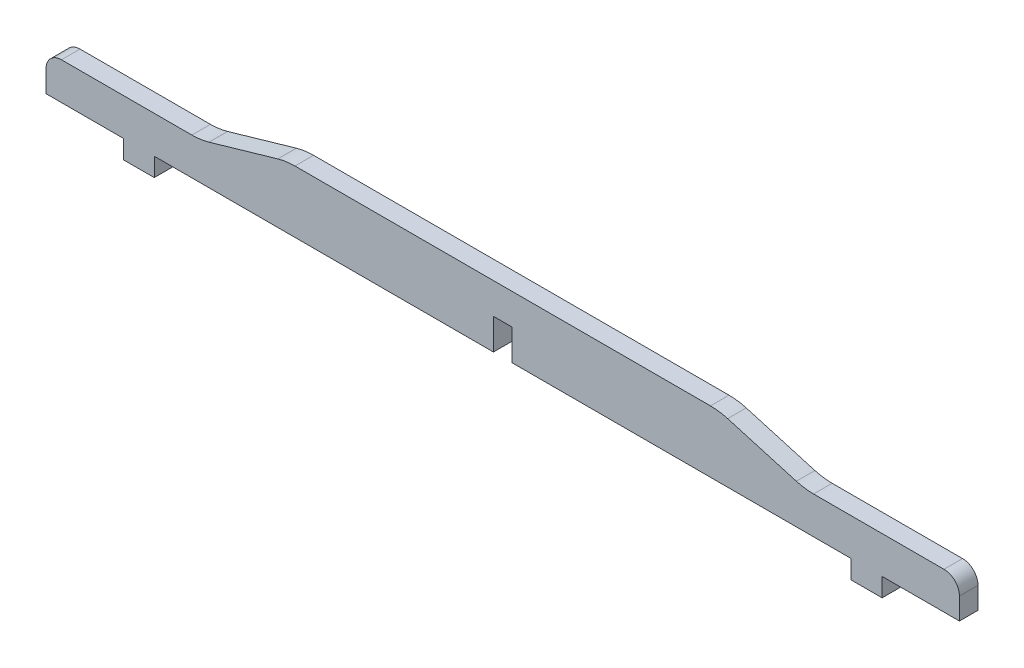
ISO-10303-21;
HEADER;
FILE_DESCRIPTION(('STEP AP214'),'2;1');
FILE_NAME('part.step','',(''),(''),'','','');
FILE_SCHEMA(('AUTOMOTIVE_DESIGN { 1 0 10303 214 1 1 1 1 }'));
ENDSEC;
DATA;
#1=APPLICATION_CONTEXT('core data for automotive mechanical design processes');
#2=APPLICATION_PROTOCOL_DEFINITION('international standard','automotive_design',2000,#1);
#3=PRODUCT_CONTEXT('',#1,'mechanical');
#4=PRODUCT('Part','Part','',(#3));
#5=PRODUCT_RELATED_PRODUCT_CATEGORY('part','',(#4));
#6=PRODUCT_DEFINITION_FORMATION('','',#4);
#7=PRODUCT_DEFINITION_CONTEXT('part definition',#1,'design');
#8=PRODUCT_DEFINITION('design','',#6,#7);
#9=PRODUCT_DEFINITION_SHAPE('','',#8);
#10=(LENGTH_UNIT() NAMED_UNIT(*) SI_UNIT(.MILLI.,.METRE.));
#11=(NAMED_UNIT(*) PLANE_ANGLE_UNIT() SI_UNIT($,.RADIAN.));
#12=(NAMED_UNIT(*) SI_UNIT($,.STERADIAN.) SOLID_ANGLE_UNIT());
#13=UNCERTAINTY_MEASURE_WITH_UNIT(LENGTH_MEASURE(1.E-05),#10,'distance_accuracy_value','');
#14=(GEOMETRIC_REPRESENTATION_CONTEXT(3) GLOBAL_UNCERTAINTY_ASSIGNED_CONTEXT((#13)) GLOBAL_UNIT_ASSIGNED_CONTEXT((#10,
#11,#12)) REPRESENTATION_CONTEXT('',''));
#15=CARTESIAN_POINT('',(0.,0.,0.));
#16=DIRECTION('',(0.,0.,1.));
#17=DIRECTION('',(1.,0.,0.));
#18=AXIS2_PLACEMENT_3D('',#15,#16,#17);
#19=CARTESIAN_POINT('',(112.66666667,-20.,6.));
#20=DIRECTION('',(0.,1.,0.));
#21=DIRECTION('',(0.,0.,1.));
#22=AXIS2_PLACEMENT_3D('',#19,#20,#21);
#23=PLANE('',#22);
#24=DIRECTION('',(1.,0.,0.));
#25=VECTOR('',#24,1.);
#26=CARTESIAN_POINT('',(112.66666667,-20.,0.));
#27=LINE('',#26,#25);
#28=CARTESIAN_POINT('',(-112.66666667,-20.,0.));
#29=VERTEX_POINT('',#28);
#30=CARTESIAN_POINT('',(-3.,-20.,0.));
#31=VERTEX_POINT('',#30);
#32=EDGE_CURVE('E230',#29,#31,#27,.T.);
#33=ORIENTED_EDGE('',*,*,#32,.T.);
#34=DIRECTION('',(0.,0.,1.));
#35=VECTOR('',#34,1.);
#36=CARTESIAN_POINT('',(-3.,-20.,0.));
#37=LINE('',#36,#35);
#38=CARTESIAN_POINT('',(-3.,-20.,6.));
#39=VERTEX_POINT('',#38);
#40=EDGE_CURVE('E212',#31,#39,#37,.T.);
#41=ORIENTED_EDGE('',*,*,#40,.T.);
#42=DIRECTION('',(1.,0.,0.));
#43=VECTOR('',#42,1.);
#44=CARTESIAN_POINT('',(112.66666667,-20.,6.));
#45=LINE('',#44,#43);
#46=CARTESIAN_POINT('',(-112.66666667,-20.,6.));
#47=VERTEX_POINT('',#46);
#48=EDGE_CURVE('E410',#47,#39,#45,.T.);
#49=ORIENTED_EDGE('',*,*,#48,.F.);
#50=DIRECTION('',(0.,0.,-1.));
#51=VECTOR('',#50,1.);
#52=CARTESIAN_POINT('',(-112.66666667,-20.,6.));
#53=LINE('',#52,#51);
#54=EDGE_CURVE('E237',#47,#29,#53,.T.);
#55=ORIENTED_EDGE('',*,*,#54,.T.);
#56=EDGE_LOOP('',(#33,#41,#49,#55));
#57=FACE_BOUND('',#56,.T.);
#58=ADVANCED_FACE('F38',(#57),#23,.F.);
#59=CARTESIAN_POINT('',(122.66666667,-26.,6.));
#60=DIRECTION('',(-1.,0.,0.));
#61=DIRECTION('',(0.,0.,1.));
#62=AXIS2_PLACEMENT_3D('',#59,#60,#61);
#63=PLANE('',#62);
#64=DIRECTION('',(0.,1.,0.));
#65=VECTOR('',#64,1.);
#66=CARTESIAN_POINT('',(122.66666667,-26.,0.));
#67=LINE('',#66,#65);
#68=CARTESIAN_POINT('',(122.66666667,-26.,0.));
#69=VERTEX_POINT('',#68);
#70=CARTESIAN_POINT('',(122.66666667,-20.,0.));
#71=VERTEX_POINT('',#70);
#72=EDGE_CURVE('E418',#69,#71,#67,.T.);
#73=ORIENTED_EDGE('',*,*,#72,.T.);
#74=DIRECTION('',(0.,0.,-1.));
#75=VECTOR('',#74,1.);
#76=CARTESIAN_POINT('',(122.66666667,-20.,6.));
#77=LINE('',#76,#75);
#78=CARTESIAN_POINT('',(122.66666667,-20.,6.));
#79=VERTEX_POINT('',#78);
#80=EDGE_CURVE('E288',#79,#71,#77,.T.);
#81=ORIENTED_EDGE('',*,*,#80,.F.);
#82=DIRECTION('',(0.,1.,0.));
#83=VECTOR('',#82,1.);
#84=CARTESIAN_POINT('',(122.66666667,-26.,6.));
#85=LINE('',#84,#83);
#86=CARTESIAN_POINT('',(122.66666667,-26.,6.));
#87=VERTEX_POINT('',#86);
#88=EDGE_CURVE('E252',#87,#79,#85,.T.);
#89=ORIENTED_EDGE('',*,*,#88,.F.);
#90=DIRECTION('',(0.,0.,-1.));
#91=VECTOR('',#90,1.);
#92=CARTESIAN_POINT('',(122.66666667,-26.,6.));
#93=LINE('',#92,#91);
#94=EDGE_CURVE('E253',#87,#69,#93,.T.);
#95=ORIENTED_EDGE('',*,*,#94,.T.);
#96=EDGE_LOOP('',(#73,#81,#89,#95));
#97=FACE_BOUND('',#96,.T.);
#98=ADVANCED_FACE('F494',(#97),#63,.F.);
#99=CARTESIAN_POINT('',(147.66666667,-20.,6.));
#100=DIRECTION('',(0.,1.,0.));
#101=DIRECTION('',(0.,0.,1.));
#102=AXIS2_PLACEMENT_3D('',#99,#100,#101);
#103=PLANE('',#102);
#104=DIRECTION('',(1.,0.,0.));
#105=VECTOR('',#104,1.);
#106=CARTESIAN_POINT('',(147.66666667,-20.,0.));
#107=LINE('',#106,#105);
#108=CARTESIAN_POINT('',(147.66666667,-20.,0.));
#109=VERTEX_POINT('',#108);
#110=EDGE_CURVE('E422',#71,#109,#107,.T.);
#111=ORIENTED_EDGE('',*,*,#110,.T.);
#112=DIRECTION('',(0.,0.,-1.));
#113=VECTOR('',#112,1.);
#114=CARTESIAN_POINT('',(147.66666667,-20.,6.));
#115=LINE('',#114,#113);
#116=CARTESIAN_POINT('',(147.66666667,-20.,6.));
#117=VERTEX_POINT('',#116);
#118=EDGE_CURVE('E284',#117,#109,#115,.T.);
#119=ORIENTED_EDGE('',*,*,#118,.F.);
#120=DIRECTION('',(1.,0.,0.));
#121=VECTOR('',#120,1.);
#122=CARTESIAN_POINT('',(147.66666667,-20.,6.));
#123=LINE('',#122,#121);
#124=EDGE_CURVE('E543',#79,#117,#123,.T.);
#125=ORIENTED_EDGE('',*,*,#124,.F.);
#126=ORIENTED_EDGE('',*,*,#80,.T.);
#127=EDGE_LOOP('',(#111,#119,#125,#126));
#128=FACE_BOUND('',#127,.T.);
#129=ADVANCED_FACE('F502',(#128),#103,.F.);
#130=CARTESIAN_POINT('',(147.66666667,-8.00000000000002,6.));
#131=DIRECTION('',(-1.,0.,0.));
#132=DIRECTION('',(0.,-1.,0.));
#133=AXIS2_PLACEMENT_3D('',#130,#131,#132);
#134=PLANE('',#133);
#135=DIRECTION('',(0.,1.,0.));
#136=VECTOR('',#135,1.);
#137=CARTESIAN_POINT('',(147.66666667,-8.00000000000002,0.));
#138=LINE('',#137,#136);
#139=CARTESIAN_POINT('',(147.66666667,-13.,0.));
#140=VERTEX_POINT('',#139);
#141=EDGE_CURVE('E425',#109,#140,#138,.T.);
#142=ORIENTED_EDGE('',*,*,#141,.T.);
#143=DIRECTION('',(0.,0.,-1.));
#144=VECTOR('',#143,1.);
#145=CARTESIAN_POINT('',(147.66666667,-13.,6.));
#146=LINE('',#145,#144);
#147=CARTESIAN_POINT('',(147.66666667,-13.,6.));
#148=VERTEX_POINT('',#147);
#149=EDGE_CURVE('E303',#140,#148,#146,.F.);
#150=ORIENTED_EDGE('',*,*,#149,.T.);
#151=DIRECTION('',(0.,1.,0.));
#152=VECTOR('',#151,1.);
#153=CARTESIAN_POINT('',(147.66666667,-8.00000000000002,6.));
#154=LINE('',#153,#152);
#155=EDGE_CURVE('E546',#117,#148,#154,.T.);
#156=ORIENTED_EDGE('',*,*,#155,.F.);
#157=ORIENTED_EDGE('',*,*,#118,.T.);
#158=EDGE_LOOP('',(#142,#150,#156,#157));
#159=FACE_BOUND('',#158,.T.);
#160=ADVANCED_FACE('F587',(#159),#134,.F.);
#161=CARTESIAN_POINT('',(97.66666667,-8.00000000000002,6.));
#162=DIRECTION('',(0.,-1.,0.));
#163=DIRECTION('',(1.,0.,0.));
#164=AXIS2_PLACEMENT_3D('',#161,#162,#163);
#165=PLANE('',#164);
#166=DIRECTION('',(-1.,0.,0.));
#167=VECTOR('',#166,1.);
#168=CARTESIAN_POINT('',(97.66666667,-8.00000000000002,0.));
#169=LINE('',#168,#167);
#170=CARTESIAN_POINT('',(142.66666667,-8.00000000000002,0.));
#171=VERTEX_POINT('',#170);
#172=CARTESIAN_POINT('',(100.500192903982,-8.00000000000002,0.));
#173=VERTEX_POINT('',#172);
#174=EDGE_CURVE('E429',#171,#173,#169,.T.);
#175=ORIENTED_EDGE('',*,*,#174,.T.);
#176=DIRECTION('',(0.,0.,-1.));
#177=VECTOR('',#176,1.);
#178=CARTESIAN_POINT('',(100.500192903982,-8.00000000000002,6.));
#179=LINE('',#178,#177);
#180=CARTESIAN_POINT('',(100.500192903982,-8.00000000000002,6.));
#181=VERTEX_POINT('',#180);
#182=EDGE_CURVE('E327',#173,#181,#179,.F.);
#183=ORIENTED_EDGE('',*,*,#182,.T.);
#184=DIRECTION('',(-1.,0.,0.));
#185=VECTOR('',#184,1.);
#186=CARTESIAN_POINT('',(97.66666667,-8.00000000000002,6.));
#187=LINE('',#186,#185);
#188=CARTESIAN_POINT('',(142.66666667,-8.00000000000002,6.));
#189=VERTEX_POINT('',#188);
#190=EDGE_CURVE('E550',#189,#181,#187,.T.);
#191=ORIENTED_EDGE('',*,*,#190,.F.);
#192=DIRECTION('',(0.,0.,-1.));
#193=VECTOR('',#192,1.);
#194=CARTESIAN_POINT('',(142.66666667,-8.00000000000002,6.));
#195=LINE('',#194,#193);
#196=EDGE_CURVE('E292',#189,#171,#195,.T.);
#197=ORIENTED_EDGE('',*,*,#196,.T.);
#198=EDGE_LOOP('',(#175,#183,#191,#197));
#199=FACE_BOUND('',#198,.T.);
#200=ADVANCED_FACE('F580',(#199),#165,.F.);
#201=CARTESIAN_POINT('',(70.,0.,6.));
#202=DIRECTION('',(-0.277777033532158,-0.960645574414453,0.));
#203=DIRECTION('',(0.960645574414453,-0.277777033532158,0.));
#204=AXIS2_PLACEMENT_3D('',#201,#202,#203);
#205=PLANE('',#204);
#206=DIRECTION('',(-0.960645574414453,0.277777033532158,0.));
#207=VECTOR('',#206,1.);
#208=CARTESIAN_POINT('',(70.,0.,6.));
#209=LINE('',#208,#207);
#210=CARTESIAN_POINT('',(94.9446522333384,-7.21291148828908,6.));
#211=VERTEX_POINT('',#210);
#212=CARTESIAN_POINT('',(72.7220144366616,-0.787088511710961,6.));
#213=VERTEX_POINT('',#212);
#214=EDGE_CURVE('E554',#211,#213,#209,.T.);
#215=ORIENTED_EDGE('',*,*,#214,.F.);
#216=DIRECTION('',(0.,0.,-1.));
#217=VECTOR('',#216,1.);
#218=CARTESIAN_POINT('',(94.9446522333384,-7.21291148828908,0.));
#219=LINE('',#218,#217);
#220=CARTESIAN_POINT('',(94.9446522333384,-7.21291148828908,0.));
#221=VERTEX_POINT('',#220);
#222=EDGE_CURVE('E323',#211,#221,#219,.T.);
#223=ORIENTED_EDGE('',*,*,#222,.T.);
#224=DIRECTION('',(-0.960645574414453,0.277777033532158,0.));
#225=VECTOR('',#224,1.);
#226=CARTESIAN_POINT('',(70.,0.,0.));
#227=LINE('',#226,#225);
#228=CARTESIAN_POINT('',(72.7220144366616,-0.787088511710961,0.));
#229=VERTEX_POINT('',#228);
#230=EDGE_CURVE('E433',#221,#229,#227,.T.);
#231=ORIENTED_EDGE('',*,*,#230,.T.);
#232=DIRECTION('',(0.,0.,-1.));
#233=VECTOR('',#232,1.);
#234=CARTESIAN_POINT('',(72.7220144366616,-0.787088511710961,6.));
#235=LINE('',#234,#233);
#236=EDGE_CURVE('E320',#229,#213,#235,.F.);
#237=ORIENTED_EDGE('',*,*,#236,.T.);
#238=EDGE_LOOP('',(#215,#223,#231,#237));
#239=FACE_BOUND('',#238,.T.);
#240=ADVANCED_FACE('F574',(#239),#205,.F.);
#241=CARTESIAN_POINT('',(70.,0.,6.));
#242=DIRECTION('',(0.,-1.,0.));
#243=DIRECTION('',(0.,0.,-1.));
#244=AXIS2_PLACEMENT_3D('',#241,#242,#243);
#245=PLANE('',#244);
#246=DIRECTION('',(-1.,0.,0.));
#247=VECTOR('',#246,1.);
#248=CARTESIAN_POINT('',(70.,0.,6.));
#249=LINE('',#248,#247);
#250=CARTESIAN_POINT('',(67.1664737660185,0.,6.));
#251=VERTEX_POINT('',#250);
#252=CARTESIAN_POINT('',(-67.1664737660185,0.,6.));
#253=VERTEX_POINT('',#252);
#254=EDGE_CURVE('E394',#251,#253,#249,.T.);
#255=ORIENTED_EDGE('',*,*,#254,.F.);
#256=DIRECTION('',(0.,0.,-1.));
#257=VECTOR('',#256,1.);
#258=CARTESIAN_POINT('',(67.1664737660185,0.,6.));
#259=LINE('',#258,#257);
#260=CARTESIAN_POINT('',(67.1664737660185,0.,0.));
#261=VERTEX_POINT('',#260);
#262=EDGE_CURVE('E333',#251,#261,#259,.T.);
#263=ORIENTED_EDGE('',*,*,#262,.T.);
#264=DIRECTION('',(-1.,0.,0.));
#265=VECTOR('',#264,1.);
#266=CARTESIAN_POINT('',(70.,0.,0.));
#267=LINE('',#266,#265);
#268=CARTESIAN_POINT('',(-67.1664737660185,0.,0.));
#269=VERTEX_POINT('',#268);
#270=EDGE_CURVE('E379',#261,#269,#267,.T.);
#271=ORIENTED_EDGE('',*,*,#270,.T.);
#272=DIRECTION('',(0.,0.,-1.));
#273=VECTOR('',#272,1.);
#274=CARTESIAN_POINT('',(-67.1664737660185,0.,6.));
#275=LINE('',#274,#273);
#276=EDGE_CURVE('E330',#269,#253,#275,.F.);
#277=ORIENTED_EDGE('',*,*,#276,.T.);
#278=EDGE_LOOP('',(#255,#263,#271,#277));
#279=FACE_BOUND('',#278,.T.);
#280=ADVANCED_FACE('F568',(#279),#245,.F.);
#281=CARTESIAN_POINT('',(-97.66666667,-8.00000000000002,6.));
#282=DIRECTION('',(0.277777033532158,-0.960645574414453,0.));
#283=DIRECTION('',(0.960645574414453,0.277777033532158,0.));
#284=AXIS2_PLACEMENT_3D('',#281,#282,#283);
#285=PLANE('',#284);
#286=DIRECTION('',(-0.960645574414453,-0.277777033532158,0.));
#287=VECTOR('',#286,1.);
#288=CARTESIAN_POINT('',(-97.66666667,-8.00000000000002,6.));
#289=LINE('',#288,#287);
#290=CARTESIAN_POINT('',(-72.7220144366616,-0.787088511710957,6.));
#291=VERTEX_POINT('',#290);
#292=CARTESIAN_POINT('',(-94.9446522333383,-7.21291148828908,6.));
#293=VERTEX_POINT('',#292);
#294=EDGE_CURVE('E388',#291,#293,#289,.T.);
#295=ORIENTED_EDGE('',*,*,#294,.F.);
#296=DIRECTION('',(0.,0.,-1.));
#297=VECTOR('',#296,1.);
#298=CARTESIAN_POINT('',(-72.7220144366616,-0.787088511710958,6.));
#299=LINE('',#298,#297);
#300=CARTESIAN_POINT('',(-72.7220144366616,-0.787088511710957,0.));
#301=VERTEX_POINT('',#300);
#302=EDGE_CURVE('E352',#291,#301,#299,.T.);
#303=ORIENTED_EDGE('',*,*,#302,.T.);
#304=DIRECTION('',(-0.960645574414453,-0.277777033532158,0.));
#305=VECTOR('',#304,1.);
#306=CARTESIAN_POINT('',(-97.66666667,-8.00000000000002,0.));
#307=LINE('',#306,#305);
#308=CARTESIAN_POINT('',(-94.9446522333383,-7.21291148828908,0.));
#309=VERTEX_POINT('',#308);
#310=EDGE_CURVE('E369',#301,#309,#307,.T.);
#311=ORIENTED_EDGE('',*,*,#310,.T.);
#312=DIRECTION('',(0.,0.,-1.));
#313=VECTOR('',#312,1.);
#314=CARTESIAN_POINT('',(-94.9446522333383,-7.21291148828908,6.));
#315=LINE('',#314,#313);
#316=EDGE_CURVE('E349',#309,#293,#315,.F.);
#317=ORIENTED_EDGE('',*,*,#316,.T.);
#318=EDGE_LOOP('',(#295,#303,#311,#317));
#319=FACE_BOUND('',#318,.T.);
#320=ADVANCED_FACE('F376',(#319),#285,.F.);
#321=CARTESIAN_POINT('',(-147.66666667,-8.00000000000002,6.));
#322=DIRECTION('',(0.,-1.,0.));
#323=DIRECTION('',(1.,0.,0.));
#324=AXIS2_PLACEMENT_3D('',#321,#322,#323);
#325=PLANE('',#324);
#326=DIRECTION('',(-1.,0.,0.));
#327=VECTOR('',#326,1.);
#328=CARTESIAN_POINT('',(-147.66666667,-8.00000000000002,6.));
#329=LINE('',#328,#327);
#330=CARTESIAN_POINT('',(-100.500192903981,-8.00000000000002,6.));
#331=VERTEX_POINT('',#330);
#332=CARTESIAN_POINT('',(-142.66666667,-8.00000000000002,6.));
#333=VERTEX_POINT('',#332);
#334=EDGE_CURVE('E383',#331,#333,#329,.T.);
#335=ORIENTED_EDGE('',*,*,#334,.F.);
#336=DIRECTION('',(0.,0.,-1.));
#337=VECTOR('',#336,1.);
#338=CARTESIAN_POINT('',(-100.500192903981,-8.00000000000003,0.));
#339=LINE('',#338,#337);
#340=CARTESIAN_POINT('',(-100.500192903981,-8.00000000000002,0.));
#341=VERTEX_POINT('',#340);
#342=EDGE_CURVE('E356',#331,#341,#339,.T.);
#343=ORIENTED_EDGE('',*,*,#342,.T.);
#344=DIRECTION('',(-1.,0.,0.));
#345=VECTOR('',#344,1.);
#346=CARTESIAN_POINT('',(-147.66666667,-8.00000000000002,0.));
#347=LINE('',#346,#345);
#348=CARTESIAN_POINT('',(-142.66666667,-8.00000000000002,0.));
#349=VERTEX_POINT('',#348);
#350=EDGE_CURVE('E370',#341,#349,#347,.T.);
#351=ORIENTED_EDGE('',*,*,#350,.T.);
#352=DIRECTION('',(0.,0.,-1.));
#353=VECTOR('',#352,1.);
#354=CARTESIAN_POINT('',(-142.66666667,-8.00000000000002,6.));
#355=LINE('',#354,#353);
#356=EDGE_CURVE('E316',#349,#333,#355,.F.);
#357=ORIENTED_EDGE('',*,*,#356,.T.);
#358=EDGE_LOOP('',(#335,#343,#351,#357));
#359=FACE_BOUND('',#358,.T.);
#360=ADVANCED_FACE('F382',(#359),#325,.F.);
#361=CARTESIAN_POINT('',(-147.66666667,-20.,6.));
#362=DIRECTION('',(1.,0.,0.));
#363=DIRECTION('',(0.,1.,0.));
#364=AXIS2_PLACEMENT_3D('',#361,#362,#363);
#365=PLANE('',#364);
#366=DIRECTION('',(0.,-1.,0.));
#367=VECTOR('',#366,1.);
#368=CARTESIAN_POINT('',(-147.66666667,-20.,6.));
#369=LINE('',#368,#367);
#370=CARTESIAN_POINT('',(-147.66666667,-13.,6.));
#371=VERTEX_POINT('',#370);
#372=CARTESIAN_POINT('',(-147.66666667,-20.,6.));
#373=VERTEX_POINT('',#372);
#374=EDGE_CURVE('E387',#371,#373,#369,.T.);
#375=ORIENTED_EDGE('',*,*,#374,.F.);
#376=DIRECTION('',(0.,0.,-1.));
#377=VECTOR('',#376,1.);
#378=CARTESIAN_POINT('',(-147.66666667,-13.,6.));
#379=LINE('',#378,#377);
#380=CARTESIAN_POINT('',(-147.66666667,-13.,0.));
#381=VERTEX_POINT('',#380);
#382=EDGE_CURVE('E312',#371,#381,#379,.T.);
#383=ORIENTED_EDGE('',*,*,#382,.T.);
#384=DIRECTION('',(0.,-1.,0.));
#385=VECTOR('',#384,1.);
#386=CARTESIAN_POINT('',(-147.66666667,-20.,0.));
#387=LINE('',#386,#385);
#388=CARTESIAN_POINT('',(-147.66666667,-20.,0.));
#389=VERTEX_POINT('',#388);
#390=EDGE_CURVE('E442',#381,#389,#387,.T.);
#391=ORIENTED_EDGE('',*,*,#390,.T.);
#392=DIRECTION('',(0.,0.,-1.));
#393=VECTOR('',#392,1.);
#394=CARTESIAN_POINT('',(-147.66666667,-20.,6.));
#395=LINE('',#394,#393);
#396=EDGE_CURVE('E280',#373,#389,#395,.T.);
#397=ORIENTED_EDGE('',*,*,#396,.F.);
#398=EDGE_LOOP('',(#375,#383,#391,#397));
#399=FACE_BOUND('',#398,.T.);
#400=ADVANCED_FACE('F476',(#399),#365,.F.);
#401=CARTESIAN_POINT('',(-147.66666667,-20.,6.));
#402=DIRECTION('',(0.,1.,0.));
#403=DIRECTION('',(0.,0.,1.));
#404=AXIS2_PLACEMENT_3D('',#401,#402,#403);
#405=PLANE('',#404);
#406=DIRECTION('',(1.,0.,0.));
#407=VECTOR('',#406,1.);
#408=CARTESIAN_POINT('',(-147.66666667,-20.,0.));
#409=LINE('',#408,#407);
#410=CARTESIAN_POINT('',(-122.66666667,-20.,0.));
#411=VERTEX_POINT('',#410);
#412=EDGE_CURVE('E445',#389,#411,#409,.T.);
#413=ORIENTED_EDGE('',*,*,#412,.T.);
#414=DIRECTION('',(0.,0.,-1.));
#415=VECTOR('',#414,1.);
#416=CARTESIAN_POINT('',(-122.66666667,-20.,6.));
#417=LINE('',#416,#415);
#418=CARTESIAN_POINT('',(-122.66666667,-20.,6.));
#419=VERTEX_POINT('',#418);
#420=EDGE_CURVE('E276',#419,#411,#417,.T.);
#421=ORIENTED_EDGE('',*,*,#420,.F.);
#422=DIRECTION('',(1.,0.,0.));
#423=VECTOR('',#422,1.);
#424=CARTESIAN_POINT('',(-147.66666667,-20.,6.));
#425=LINE('',#424,#423);
#426=EDGE_CURVE('E392',#373,#419,#425,.T.);
#427=ORIENTED_EDGE('',*,*,#426,.F.);
#428=ORIENTED_EDGE('',*,*,#396,.T.);
#429=EDGE_LOOP('',(#413,#421,#427,#428));
#430=FACE_BOUND('',#429,.T.);
#431=ADVANCED_FACE('F474',(#430),#405,.F.);
#432=CARTESIAN_POINT('',(-122.66666667,-20.,6.));
#433=DIRECTION('',(1.,0.,0.));
#434=DIRECTION('',(0.,0.,-1.));
#435=AXIS2_PLACEMENT_3D('',#432,#433,#434);
#436=PLANE('',#435);
#437=DIRECTION('',(0.,-1.,0.));
#438=VECTOR('',#437,1.);
#439=CARTESIAN_POINT('',(-122.66666667,-20.,0.));
#440=LINE('',#439,#438);
#441=CARTESIAN_POINT('',(-122.66666667,-26.,0.));
#442=VERTEX_POINT('',#441);
#443=EDGE_CURVE('E448',#411,#442,#440,.T.);
#444=ORIENTED_EDGE('',*,*,#443,.T.);
#445=DIRECTION('',(0.,0.,-1.));
#446=VECTOR('',#445,1.);
#447=CARTESIAN_POINT('',(-122.66666667,-26.,6.));
#448=LINE('',#447,#446);
#449=CARTESIAN_POINT('',(-122.66666667,-26.,6.));
#450=VERTEX_POINT('',#449);
#451=EDGE_CURVE('E272',#450,#442,#448,.T.);
#452=ORIENTED_EDGE('',*,*,#451,.F.);
#453=DIRECTION('',(0.,-1.,0.));
#454=VECTOR('',#453,1.);
#455=CARTESIAN_POINT('',(-122.66666667,-20.,6.));
#456=LINE('',#455,#454);
#457=EDGE_CURVE('E400',#419,#450,#456,.T.);
#458=ORIENTED_EDGE('',*,*,#457,.F.);
#459=ORIENTED_EDGE('',*,*,#420,.T.);
#460=EDGE_LOOP('',(#444,#452,#458,#459));
#461=FACE_BOUND('',#460,.T.);
#462=ADVANCED_FACE('F464',(#461),#436,.F.);
#463=CARTESIAN_POINT('',(-122.66666667,-26.,6.));
#464=DIRECTION('',(0.,1.,0.));
#465=DIRECTION('',(0.,0.,1.));
#466=AXIS2_PLACEMENT_3D('',#463,#464,#465);
#467=PLANE('',#466);
#468=DIRECTION('',(1.,0.,0.));
#469=VECTOR('',#468,1.);
#470=CARTESIAN_POINT('',(-122.66666667,-26.,0.));
#471=LINE('',#470,#469);
#472=CARTESIAN_POINT('',(-112.66666667,-26.,0.));
#473=VERTEX_POINT('',#472);
#474=EDGE_CURVE('E450',#442,#473,#471,.T.);
#475=ORIENTED_EDGE('',*,*,#474,.T.);
#476=DIRECTION('',(0.,0.,-1.));
#477=VECTOR('',#476,1.);
#478=CARTESIAN_POINT('',(-112.66666667,-26.,6.));
#479=LINE('',#478,#477);
#480=CARTESIAN_POINT('',(-112.66666667,-26.,6.));
#481=VERTEX_POINT('',#480);
#482=EDGE_CURVE('E268',#481,#473,#479,.T.);
#483=ORIENTED_EDGE('',*,*,#482,.F.);
#484=DIRECTION('',(1.,0.,0.));
#485=VECTOR('',#484,1.);
#486=CARTESIAN_POINT('',(-122.66666667,-26.,6.));
#487=LINE('',#486,#485);
#488=EDGE_CURVE('E403',#450,#481,#487,.T.);
#489=ORIENTED_EDGE('',*,*,#488,.F.);
#490=ORIENTED_EDGE('',*,*,#451,.T.);
#491=EDGE_LOOP('',(#475,#483,#489,#490));
#492=FACE_BOUND('',#491,.T.);
#493=ADVANCED_FACE('F468',(#492),#467,.F.);
#494=CARTESIAN_POINT('',(-112.66666667,-26.,6.));
#495=DIRECTION('',(-1.,0.,0.));
#496=DIRECTION('',(0.,0.,1.));
#497=AXIS2_PLACEMENT_3D('',#494,#495,#496);
#498=PLANE('',#497);
#499=DIRECTION('',(0.,1.,0.));
#500=VECTOR('',#499,1.);
#501=CARTESIAN_POINT('',(-112.66666667,-26.,0.));
#502=LINE('',#501,#500);
#503=EDGE_CURVE('E246',#473,#29,#502,.T.);
#504=ORIENTED_EDGE('',*,*,#503,.T.);
#505=ORIENTED_EDGE('',*,*,#54,.F.);
#506=DIRECTION('',(0.,1.,0.));
#507=VECTOR('',#506,1.);
#508=CARTESIAN_POINT('',(-112.66666667,-26.,6.));
#509=LINE('',#508,#507);
#510=EDGE_CURVE('E406',#481,#47,#509,.T.);
#511=ORIENTED_EDGE('',*,*,#510,.F.);
#512=ORIENTED_EDGE('',*,*,#482,.T.);
#513=EDGE_LOOP('',(#504,#505,#511,#512));
#514=FACE_BOUND('',#513,.T.);
#515=ADVANCED_FACE('F457',(#514),#498,.F.);
#516=CARTESIAN_POINT('',(3.,-20.,6.));
#517=VERTEX_POINT('',#516);
#518=CARTESIAN_POINT('',(112.66666667,-20.,6.));
#519=VERTEX_POINT('',#518);
#520=EDGE_CURVE('E409',#517,#519,#45,.T.);
#521=ORIENTED_EDGE('',*,*,#520,.F.);
#522=DIRECTION('',(0.,0.,1.));
#523=VECTOR('',#522,1.);
#524=CARTESIAN_POINT('',(3.,-20.,0.));
#525=LINE('',#524,#523);
#526=CARTESIAN_POINT('',(3.,-20.,0.));
#527=VERTEX_POINT('',#526);
#528=EDGE_CURVE('E224',#527,#517,#525,.T.);
#529=ORIENTED_EDGE('',*,*,#528,.F.);
#530=CARTESIAN_POINT('',(112.66666667,-20.,0.));
#531=VERTEX_POINT('',#530);
#532=EDGE_CURVE('E240',#527,#531,#27,.T.);
#533=ORIENTED_EDGE('',*,*,#532,.T.);
#534=DIRECTION('',(0.,0.,-1.));
#535=VECTOR('',#534,1.);
#536=CARTESIAN_POINT('',(112.66666667,-20.,6.));
#537=LINE('',#536,#535);
#538=EDGE_CURVE('E262',#519,#531,#537,.T.);
#539=ORIENTED_EDGE('',*,*,#538,.F.);
#540=EDGE_LOOP('',(#521,#529,#533,#539));
#541=FACE_BOUND('',#540,.T.);
#542=ADVANCED_FACE('F496',(#541),#23,.F.);
#543=CARTESIAN_POINT('',(112.66666667,-20.,6.));
#544=DIRECTION('',(1.,0.,0.));
#545=DIRECTION('',(0.,0.,-1.));
#546=AXIS2_PLACEMENT_3D('',#543,#544,#545);
#547=PLANE('',#546);
#548=DIRECTION('',(0.,-1.,0.));
#549=VECTOR('',#548,1.);
#550=CARTESIAN_POINT('',(112.66666667,-20.,0.));
#551=LINE('',#550,#549);
#552=CARTESIAN_POINT('',(112.66666667,-26.,0.));
#553=VERTEX_POINT('',#552);
#554=EDGE_CURVE('E239',#531,#553,#551,.T.);
#555=ORIENTED_EDGE('',*,*,#554,.T.);
#556=DIRECTION('',(0.,0.,-1.));
#557=VECTOR('',#556,1.);
#558=CARTESIAN_POINT('',(112.66666667,-26.,6.));
#559=LINE('',#558,#557);
#560=CARTESIAN_POINT('',(112.66666667,-26.,6.));
#561=VERTEX_POINT('',#560);
#562=EDGE_CURVE('E257',#561,#553,#559,.T.);
#563=ORIENTED_EDGE('',*,*,#562,.F.);
#564=DIRECTION('',(0.,-1.,0.));
#565=VECTOR('',#564,1.);
#566=CARTESIAN_POINT('',(112.66666667,-20.,6.));
#567=LINE('',#566,#565);
#568=EDGE_CURVE('E413',#519,#561,#567,.T.);
#569=ORIENTED_EDGE('',*,*,#568,.F.);
#570=ORIENTED_EDGE('',*,*,#538,.T.);
#571=EDGE_LOOP('',(#555,#563,#569,#570));
#572=FACE_BOUND('',#571,.T.);
#573=ADVANCED_FACE('F507',(#572),#547,.F.);
#574=CARTESIAN_POINT('',(112.66666667,-26.,6.));
#575=DIRECTION('',(0.,1.,0.));
#576=DIRECTION('',(0.,0.,1.));
#577=AXIS2_PLACEMENT_3D('',#574,#575,#576);
#578=PLANE('',#577);
#579=DIRECTION('',(1.,0.,0.));
#580=VECTOR('',#579,1.);
#581=CARTESIAN_POINT('',(112.66666667,-26.,0.));
#582=LINE('',#581,#580);
#583=EDGE_CURVE('E244',#553,#69,#582,.T.);
#584=ORIENTED_EDGE('',*,*,#583,.T.);
#585=ORIENTED_EDGE('',*,*,#94,.F.);
#586=DIRECTION('',(1.,0.,0.));
#587=VECTOR('',#586,1.);
#588=CARTESIAN_POINT('',(112.66666667,-26.,6.));
#589=LINE('',#588,#587);
#590=EDGE_CURVE('E258',#561,#87,#589,.T.);
#591=ORIENTED_EDGE('',*,*,#590,.F.);
#592=ORIENTED_EDGE('',*,*,#562,.T.);
#593=EDGE_LOOP('',(#584,#585,#591,#592));
#594=FACE_BOUND('',#593,.T.);
#595=ADVANCED_FACE('F513',(#594),#578,.F.);
#596=CARTESIAN_POINT('',(0.,0.,6.));
#597=DIRECTION('',(0.,0.,1.));
#598=DIRECTION('',(1.,0.,0.));
#599=AXIS2_PLACEMENT_3D('',#596,#597,#598);
#600=PLANE('',#599);
#601=DIRECTION('',(0.,-1.,0.));
#602=VECTOR('',#601,1.);
#603=CARTESIAN_POINT('',(-3.,0.,6.));
#604=LINE('',#603,#602);
#605=CARTESIAN_POINT('',(-3.,-10.,6.));
#606=VERTEX_POINT('',#605);
#607=EDGE_CURVE('E218',#606,#39,#604,.T.);
#608=ORIENTED_EDGE('',*,*,#607,.F.);
#609=DIRECTION('',(-1.,0.,0.));
#610=VECTOR('',#609,1.);
#611=CARTESIAN_POINT('',(0.,-10.,6.));
#612=LINE('',#611,#610);
#613=CARTESIAN_POINT('',(3.,-10.,6.));
#614=VERTEX_POINT('',#613);
#615=EDGE_CURVE('E526',#614,#606,#612,.T.);
#616=ORIENTED_EDGE('',*,*,#615,.F.);
#617=DIRECTION('',(0.,1.,0.));
#618=VECTOR('',#617,1.);
#619=CARTESIAN_POINT('',(3.,0.,6.));
#620=LINE('',#619,#618);
#621=EDGE_CURVE('E525',#517,#614,#620,.T.);
#622=ORIENTED_EDGE('',*,*,#621,.F.);
#623=ORIENTED_EDGE('',*,*,#520,.T.);
#624=ORIENTED_EDGE('',*,*,#568,.T.);
#625=ORIENTED_EDGE('',*,*,#590,.T.);
#626=ORIENTED_EDGE('',*,*,#88,.T.);
#627=ORIENTED_EDGE('',*,*,#124,.T.);
#628=ORIENTED_EDGE('',*,*,#155,.T.);
#629=CARTESIAN_POINT('',(142.66666667,-13.,6.));
#630=DIRECTION('',(0.,0.,1.));
#631=DIRECTION('',(1.,0.,0.));
#632=AXIS2_PLACEMENT_3D('',#629,#630,#631);
#633=CIRCLE('',#632,5.);
#634=EDGE_CURVE('E309',#148,#189,#633,.T.);
#635=ORIENTED_EDGE('',*,*,#634,.T.);
#636=ORIENTED_EDGE('',*,*,#190,.T.);
#637=CARTESIAN_POINT('',(100.500192903982,12.,6.));
#638=DIRECTION('',(0.,0.,1.));
#639=DIRECTION('',(1.,0.,0.));
#640=AXIS2_PLACEMENT_3D('',#637,#638,#639);
#641=CIRCLE('',#640,20.);
#642=EDGE_CURVE('E363',#181,#211,#641,.F.);
#643=ORIENTED_EDGE('',*,*,#642,.T.);
#644=ORIENTED_EDGE('',*,*,#214,.T.);
#645=CARTESIAN_POINT('',(67.1664737660185,-20.,6.));
#646=DIRECTION('',(0.,0.,1.));
#647=DIRECTION('',(1.,0.,0.));
#648=AXIS2_PLACEMENT_3D('',#645,#646,#647);
#649=CIRCLE('',#648,20.);
#650=EDGE_CURVE('E346',#213,#251,#649,.T.);
#651=ORIENTED_EDGE('',*,*,#650,.T.);
#652=ORIENTED_EDGE('',*,*,#254,.T.);
#653=CARTESIAN_POINT('',(-67.1664737660185,-20.,6.));
#654=DIRECTION('',(0.,0.,1.));
#655=DIRECTION('',(1.,0.,0.));
#656=AXIS2_PLACEMENT_3D('',#653,#654,#655);
#657=CIRCLE('',#656,20.);
#658=EDGE_CURVE('E343',#253,#291,#657,.T.);
#659=ORIENTED_EDGE('',*,*,#658,.T.);
#660=ORIENTED_EDGE('',*,*,#294,.T.);
#661=CARTESIAN_POINT('',(-100.500192903981,12.,6.));
#662=DIRECTION('',(0.,0.,1.));
#663=DIRECTION('',(1.,0.,0.));
#664=AXIS2_PLACEMENT_3D('',#661,#662,#663);
#665=CIRCLE('',#664,20.);
#666=EDGE_CURVE('E11',#293,#331,#665,.F.);
#667=ORIENTED_EDGE('',*,*,#666,.T.);
#668=ORIENTED_EDGE('',*,*,#334,.T.);
#669=CARTESIAN_POINT('',(-142.66666667,-13.,6.));
#670=DIRECTION('',(0.,0.,1.));
#671=DIRECTION('',(1.,0.,0.));
#672=AXIS2_PLACEMENT_3D('',#669,#670,#671);
#673=CIRCLE('',#672,5.);
#674=EDGE_CURVE('E306',#333,#371,#673,.T.);
#675=ORIENTED_EDGE('',*,*,#674,.T.);
#676=ORIENTED_EDGE('',*,*,#374,.T.);
#677=ORIENTED_EDGE('',*,*,#426,.T.);
#678=ORIENTED_EDGE('',*,*,#457,.T.);
#679=ORIENTED_EDGE('',*,*,#488,.T.);
#680=ORIENTED_EDGE('',*,*,#510,.T.);
#681=ORIENTED_EDGE('',*,*,#48,.T.);
#682=EDGE_LOOP('',(#608,#616,#622,#623,#624,#625,#626,#627,#628,#635,#636,#643,#644,#651,#652,
#659,#660,#667,#668,#675,#676,#677,#678,#679,#680,#681));
#683=FACE_BOUND('',#682,.T.);
#684=ADVANCED_FACE('F469',(#683),#600,.T.);
#685=CARTESIAN_POINT('',(0.,0.,0.));
#686=DIRECTION('',(0.,0.,1.));
#687=DIRECTION('',(1.,0.,0.));
#688=AXIS2_PLACEMENT_3D('',#685,#686,#687);
#689=PLANE('',#688);
#690=DIRECTION('',(-1.,0.,0.));
#691=VECTOR('',#690,1.);
#692=CARTESIAN_POINT('',(-3.,-10.,0.));
#693=LINE('',#692,#691);
#694=CARTESIAN_POINT('',(3.,-10.,0.));
#695=VERTEX_POINT('',#694);
#696=CARTESIAN_POINT('',(-3.,-10.,0.));
#697=VERTEX_POINT('',#696);
#698=EDGE_CURVE('E54',#695,#697,#693,.T.);
#699=ORIENTED_EDGE('',*,*,#698,.T.);
#700=DIRECTION('',(0.,-1.,0.));
#701=VECTOR('',#700,1.);
#702=CARTESIAN_POINT('',(-3.,-20.,0.));
#703=LINE('',#702,#701);
#704=EDGE_CURVE('E216',#697,#31,#703,.T.);
#705=ORIENTED_EDGE('',*,*,#704,.T.);
#706=ORIENTED_EDGE('',*,*,#32,.F.);
#707=ORIENTED_EDGE('',*,*,#503,.F.);
#708=ORIENTED_EDGE('',*,*,#474,.F.);
#709=ORIENTED_EDGE('',*,*,#443,.F.);
#710=ORIENTED_EDGE('',*,*,#412,.F.);
#711=ORIENTED_EDGE('',*,*,#390,.F.);
#712=CARTESIAN_POINT('',(-142.66666667,-13.,0.));
#713=DIRECTION('',(0.,0.,1.));
#714=DIRECTION('',(1.,0.,0.));
#715=AXIS2_PLACEMENT_3D('',#712,#713,#714);
#716=CIRCLE('',#715,5.);
#717=EDGE_CURVE('E296',#381,#349,#716,.F.);
#718=ORIENTED_EDGE('',*,*,#717,.T.);
#719=ORIENTED_EDGE('',*,*,#350,.F.);
#720=CARTESIAN_POINT('',(-100.500192903981,12.,0.));
#721=DIRECTION('',(0.,0.,1.));
#722=DIRECTION('',(1.,0.,0.));
#723=AXIS2_PLACEMENT_3D('',#720,#721,#722);
#724=CIRCLE('',#723,20.);
#725=EDGE_CURVE('E47',#341,#309,#724,.T.);
#726=ORIENTED_EDGE('',*,*,#725,.T.);
#727=ORIENTED_EDGE('',*,*,#310,.F.);
#728=CARTESIAN_POINT('',(-67.1664737660185,-20.,0.));
#729=DIRECTION('',(0.,0.,1.));
#730=DIRECTION('',(1.,0.,0.));
#731=AXIS2_PLACEMENT_3D('',#728,#729,#730);
#732=CIRCLE('',#731,20.);
#733=EDGE_CURVE('E337',#301,#269,#732,.F.);
#734=ORIENTED_EDGE('',*,*,#733,.T.);
#735=ORIENTED_EDGE('',*,*,#270,.F.);
#736=CARTESIAN_POINT('',(67.1664737660185,-20.,0.));
#737=DIRECTION('',(0.,0.,1.));
#738=DIRECTION('',(1.,0.,0.));
#739=AXIS2_PLACEMENT_3D('',#736,#737,#738);
#740=CIRCLE('',#739,20.);
#741=EDGE_CURVE('E340',#261,#229,#740,.F.);
#742=ORIENTED_EDGE('',*,*,#741,.T.);
#743=ORIENTED_EDGE('',*,*,#230,.F.);
#744=CARTESIAN_POINT('',(100.500192903982,12.,0.));
#745=DIRECTION('',(0.,0.,1.));
#746=DIRECTION('',(1.,0.,0.));
#747=AXIS2_PLACEMENT_3D('',#744,#745,#746);
#748=CIRCLE('',#747,20.);
#749=EDGE_CURVE('E360',#221,#173,#748,.T.);
#750=ORIENTED_EDGE('',*,*,#749,.T.);
#751=ORIENTED_EDGE('',*,*,#174,.F.);
#752=CARTESIAN_POINT('',(142.66666667,-13.,0.));
#753=DIRECTION('',(0.,0.,1.));
#754=DIRECTION('',(1.,0.,0.));
#755=AXIS2_PLACEMENT_3D('',#752,#753,#754);
#756=CIRCLE('',#755,5.);
#757=EDGE_CURVE('E300',#171,#140,#756,.F.);
#758=ORIENTED_EDGE('',*,*,#757,.T.);
#759=ORIENTED_EDGE('',*,*,#141,.F.);
#760=ORIENTED_EDGE('',*,*,#110,.F.);
#761=ORIENTED_EDGE('',*,*,#72,.F.);
#762=ORIENTED_EDGE('',*,*,#583,.F.);
#763=ORIENTED_EDGE('',*,*,#554,.F.);
#764=ORIENTED_EDGE('',*,*,#532,.F.);
#765=DIRECTION('',(0.,1.,0.));
#766=VECTOR('',#765,1.);
#767=CARTESIAN_POINT('',(3.,-20.,0.));
#768=LINE('',#767,#766);
#769=EDGE_CURVE('E233',#527,#695,#768,.T.);
#770=ORIENTED_EDGE('',*,*,#769,.T.);
#771=EDGE_LOOP('',(#699,#705,#706,#707,#708,#709,#710,#711,#718,#719,#726,#727,#734,#735,#742,
#743,#750,#751,#758,#759,#760,#761,#762,#763,#764,#770));
#772=FACE_BOUND('',#771,.T.);
#773=ADVANCED_FACE('F228',(#772),#689,.F.);
#774=CARTESIAN_POINT('',(142.66666667,-13.,6.));
#775=DIRECTION('',(0.,0.,-1.));
#776=DIRECTION('',(-1.,0.,0.));
#777=AXIS2_PLACEMENT_3D('',#774,#775,#776);
#778=CYLINDRICAL_SURFACE('',#777,5.);
#779=ORIENTED_EDGE('',*,*,#634,.F.);
#780=ORIENTED_EDGE('',*,*,#149,.F.);
#781=ORIENTED_EDGE('',*,*,#757,.F.);
#782=ORIENTED_EDGE('',*,*,#196,.F.);
#783=EDGE_LOOP('',(#779,#780,#781,#782));
#784=FACE_BOUND('',#783,.T.);
#785=ADVANCED_FACE('F482',(#784),#778,.T.);
#786=CARTESIAN_POINT('',(-142.66666667,-13.,6.));
#787=DIRECTION('',(0.,0.,-1.));
#788=DIRECTION('',(-1.,0.,0.));
#789=AXIS2_PLACEMENT_3D('',#786,#787,#788);
#790=CYLINDRICAL_SURFACE('',#789,5.);
#791=ORIENTED_EDGE('',*,*,#674,.F.);
#792=ORIENTED_EDGE('',*,*,#356,.F.);
#793=ORIENTED_EDGE('',*,*,#717,.F.);
#794=ORIENTED_EDGE('',*,*,#382,.F.);
#795=EDGE_LOOP('',(#791,#792,#793,#794));
#796=FACE_BOUND('',#795,.T.);
#797=ADVANCED_FACE('F479',(#796),#790,.T.);
#798=CARTESIAN_POINT('',(100.500192903982,12.,6.));
#799=DIRECTION('',(0.,0.,1.));
#800=DIRECTION('',(1.,0.,0.));
#801=AXIS2_PLACEMENT_3D('',#798,#799,#800);
#802=CYLINDRICAL_SURFACE('',#801,20.);
#803=ORIENTED_EDGE('',*,*,#642,.F.);
#804=ORIENTED_EDGE('',*,*,#182,.F.);
#805=ORIENTED_EDGE('',*,*,#749,.F.);
#806=ORIENTED_EDGE('',*,*,#222,.F.);
#807=EDGE_LOOP('',(#803,#804,#805,#806));
#808=FACE_BOUND('',#807,.T.);
#809=ADVANCED_FACE('F481',(#808),#802,.F.);
#810=CARTESIAN_POINT('',(67.1664737660185,-20.,6.));
#811=DIRECTION('',(0.,0.,-1.));
#812=DIRECTION('',(-1.,0.,0.));
#813=AXIS2_PLACEMENT_3D('',#810,#811,#812);
#814=CYLINDRICAL_SURFACE('',#813,20.);
#815=ORIENTED_EDGE('',*,*,#650,.F.);
#816=ORIENTED_EDGE('',*,*,#236,.F.);
#817=ORIENTED_EDGE('',*,*,#741,.F.);
#818=ORIENTED_EDGE('',*,*,#262,.F.);
#819=EDGE_LOOP('',(#815,#816,#817,#818));
#820=FACE_BOUND('',#819,.T.);
#821=ADVANCED_FACE('F488',(#820),#814,.T.);
#822=CARTESIAN_POINT('',(-67.1664737660185,-20.,6.));
#823=DIRECTION('',(0.,0.,-1.));
#824=DIRECTION('',(-1.,0.,0.));
#825=AXIS2_PLACEMENT_3D('',#822,#823,#824);
#826=CYLINDRICAL_SURFACE('',#825,20.);
#827=ORIENTED_EDGE('',*,*,#658,.F.);
#828=ORIENTED_EDGE('',*,*,#276,.F.);
#829=ORIENTED_EDGE('',*,*,#733,.F.);
#830=ORIENTED_EDGE('',*,*,#302,.F.);
#831=EDGE_LOOP('',(#827,#828,#829,#830));
#832=FACE_BOUND('',#831,.T.);
#833=ADVANCED_FACE('F566',(#832),#826,.T.);
#834=CARTESIAN_POINT('',(-100.500192903981,12.,6.));
#835=DIRECTION('',(0.,0.,1.));
#836=DIRECTION('',(1.,0.,0.));
#837=AXIS2_PLACEMENT_3D('',#834,#835,#836);
#838=CYLINDRICAL_SURFACE('',#837,20.);
#839=ORIENTED_EDGE('',*,*,#666,.F.);
#840=ORIENTED_EDGE('',*,*,#316,.F.);
#841=ORIENTED_EDGE('',*,*,#725,.F.);
#842=ORIENTED_EDGE('',*,*,#342,.F.);
#843=EDGE_LOOP('',(#839,#840,#841,#842));
#844=FACE_BOUND('',#843,.T.);
#845=ADVANCED_FACE('F40',(#844),#838,.F.);
#846=CARTESIAN_POINT('',(-3.,-20.,0.));
#847=DIRECTION('',(-1.,0.,0.));
#848=DIRECTION('',(0.,0.,1.));
#849=AXIS2_PLACEMENT_3D('',#846,#847,#848);
#850=PLANE('',#849);
#851=ORIENTED_EDGE('',*,*,#607,.T.);
#852=ORIENTED_EDGE('',*,*,#40,.F.);
#853=ORIENTED_EDGE('',*,*,#704,.F.);
#854=DIRECTION('',(0.,0.,1.));
#855=VECTOR('',#854,1.);
#856=CARTESIAN_POINT('',(-3.,-10.,0.));
#857=LINE('',#856,#855);
#858=EDGE_CURVE('E529',#697,#606,#857,.T.);
#859=ORIENTED_EDGE('',*,*,#858,.T.);
#860=EDGE_LOOP('',(#851,#852,#853,#859));
#861=FACE_BOUND('',#860,.T.);
#862=ADVANCED_FACE('F214',(#861),#850,.F.);
#863=CARTESIAN_POINT('',(-3.,-10.,0.));
#864=DIRECTION('',(0.,1.,0.));
#865=DIRECTION('',(0.,0.,1.));
#866=AXIS2_PLACEMENT_3D('',#863,#864,#865);
#867=PLANE('',#866);
#868=ORIENTED_EDGE('',*,*,#615,.T.);
#869=ORIENTED_EDGE('',*,*,#858,.F.);
#870=ORIENTED_EDGE('',*,*,#698,.F.);
#871=DIRECTION('',(0.,0.,1.));
#872=VECTOR('',#871,1.);
#873=CARTESIAN_POINT('',(3.,-10.,0.));
#874=LINE('',#873,#872);
#875=EDGE_CURVE('E534',#695,#614,#874,.T.);
#876=ORIENTED_EDGE('',*,*,#875,.T.);
#877=EDGE_LOOP('',(#868,#869,#870,#876));
#878=FACE_BOUND('',#877,.T.);
#879=ADVANCED_FACE('F608',(#878),#867,.F.);
#880=CARTESIAN_POINT('',(3.,-20.,0.));
#881=DIRECTION('',(1.,0.,0.));
#882=DIRECTION('',(0.,1.,0.));
#883=AXIS2_PLACEMENT_3D('',#880,#881,#882);
#884=PLANE('',#883);
#885=ORIENTED_EDGE('',*,*,#621,.T.);
#886=ORIENTED_EDGE('',*,*,#875,.F.);
#887=ORIENTED_EDGE('',*,*,#769,.F.);
#888=ORIENTED_EDGE('',*,*,#528,.T.);
#889=EDGE_LOOP('',(#885,#886,#887,#888));
#890=FACE_BOUND('',#889,.T.);
#891=ADVANCED_FACE('F606',(#890),#884,.F.);
#892=CLOSED_SHELL('',(#58,#98,#129,#160,#200,#240,#280,#320,#360,#400,#431,#462,#493,#515,#542,
#573,#595,#684,#773,#785,#797,#809,#821,#833,#845,#862,#879,#891));
#893=MANIFOLD_SOLID_BREP('B2',#892);
#894=ADVANCED_BREP_SHAPE_REPRESENTATION('',(#18,#893),#14);
#895=SHAPE_DEFINITION_REPRESENTATION(#9,#894);
ENDSEC;
END-ISO-10303-21;
